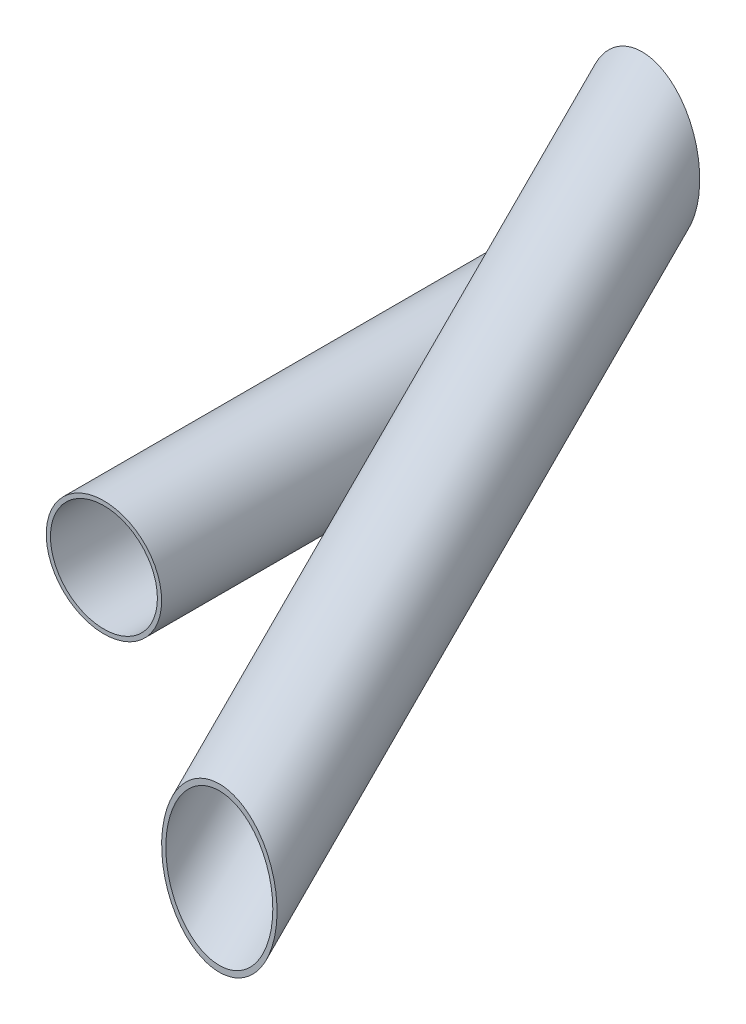
ISO-10303-21;
HEADER;
FILE_DESCRIPTION(('STEP AP214'),'2;1');
FILE_NAME('part.step','',(''),(''),'','','');
FILE_SCHEMA(('AUTOMOTIVE_DESIGN { 1 0 10303 214 1 1 1 1 }'));
ENDSEC;
DATA;
#1=APPLICATION_CONTEXT('core data for automotive mechanical design processes');
#2=APPLICATION_PROTOCOL_DEFINITION('international standard','automotive_design',2000,#1);
#3=PRODUCT_CONTEXT('',#1,'mechanical');
#4=PRODUCT('Part','Part','',(#3));
#5=PRODUCT_RELATED_PRODUCT_CATEGORY('part','',(#4));
#6=PRODUCT_DEFINITION_FORMATION('','',#4);
#7=PRODUCT_DEFINITION_CONTEXT('part definition',#1,'design');
#8=PRODUCT_DEFINITION('design','',#6,#7);
#9=PRODUCT_DEFINITION_SHAPE('','',#8);
#10=(LENGTH_UNIT() NAMED_UNIT(*) SI_UNIT(.MILLI.,.METRE.));
#11=(NAMED_UNIT(*) PLANE_ANGLE_UNIT() SI_UNIT($,.RADIAN.));
#12=(NAMED_UNIT(*) SI_UNIT($,.STERADIAN.) SOLID_ANGLE_UNIT());
#13=UNCERTAINTY_MEASURE_WITH_UNIT(LENGTH_MEASURE(1.E-05),#10,'distance_accuracy_value','');
#14=(GEOMETRIC_REPRESENTATION_CONTEXT(3) GLOBAL_UNCERTAINTY_ASSIGNED_CONTEXT((#13)) GLOBAL_UNIT_ASSIGNED_CONTEXT((#10,
#11,#12)) REPRESENTATION_CONTEXT('',''));
#15=CARTESIAN_POINT('',(0.,0.,0.));
#16=DIRECTION('',(0.,0.,1.));
#17=DIRECTION('',(1.,0.,0.));
#18=AXIS2_PLACEMENT_3D('',#15,#16,#17);
#19=CARTESIAN_POINT('',(27.3,-82.954015126393,82.9540151263927));
#20=DIRECTION('',(0.,0.707106781186549,-0.707106781186546));
#21=DIRECTION('',(0.,0.707106781186546,0.707106781186549));
#22=AXIS2_PLACEMENT_3D('',#19,#20,#21);
#23=CYLINDRICAL_SURFACE('',#22,13.65);
#24=CARTESIAN_POINT('',(27.3,-50.0000000000002,50.));
#25=DIRECTION('',(0.,0.,1.));
#26=DIRECTION('',(0.,1.,0.));
#27=AXIS2_PLACEMENT_3D('',#24,#25,#26);
#28=ELLIPSE('',#27,19.3040151263928,13.65);
#29=CARTESIAN_POINT('',(27.3,-30.6959848736074,50.));
#30=VERTEX_POINT('',#29);
#31=EDGE_CURVE('E11',#30,#30,#28,.T.);
#32=ORIENTED_EDGE('',*,*,#31,.F.);
#33=EDGE_LOOP('',(#32));
#34=FACE_BOUND('',#33,.T.);
#35=CARTESIAN_POINT('',(27.3,50.0000000000002,-50.));
#36=DIRECTION('',(0.,0.,1.));
#37=DIRECTION('',(0.,-1.,0.));
#38=AXIS2_PLACEMENT_3D('',#35,#36,#37);
#39=ELLIPSE('',#38,19.3040151263928,13.65);
#40=CARTESIAN_POINT('',(27.3,30.6959848736074,-50.));
#41=VERTEX_POINT('',#40);
#42=EDGE_CURVE('E49',#41,#41,#39,.F.);
#43=ORIENTED_EDGE('',*,*,#42,.F.);
#44=EDGE_LOOP('',(#43));
#45=FACE_BOUND('',#44,.T.);
#46=ADVANCED_FACE('F39',(#34,#45),#23,.T.);
#47=CARTESIAN_POINT('',(27.3,-82.954015126393,82.9540151263927));
#48=DIRECTION('',(0.,0.707106781186549,-0.707106781186546));
#49=DIRECTION('',(0.,0.707106781186546,0.707106781186549));
#50=AXIS2_PLACEMENT_3D('',#47,#48,#49);
#51=CYLINDRICAL_SURFACE('',#50,12.65);
#52=CARTESIAN_POINT('',(27.3,-50.0000000000002,50.));
#53=DIRECTION('',(0.,0.,1.));
#54=DIRECTION('',(0.,1.,0.));
#55=AXIS2_PLACEMENT_3D('',#52,#53,#54);
#56=ELLIPSE('',#55,17.8898015640197,12.65);
#57=CARTESIAN_POINT('',(27.3,-32.1101984359805,50.));
#58=VERTEX_POINT('',#57);
#59=EDGE_CURVE('E42',#58,#58,#56,.T.);
#60=ORIENTED_EDGE('',*,*,#59,.T.);
#61=EDGE_LOOP('',(#60));
#62=FACE_BOUND('',#61,.T.);
#63=CARTESIAN_POINT('',(27.3,50.0000000000002,-50.));
#64=DIRECTION('',(0.,0.,1.));
#65=DIRECTION('',(0.,-1.,0.));
#66=AXIS2_PLACEMENT_3D('',#63,#64,#65);
#67=ELLIPSE('',#66,17.8898015640197,12.65);
#68=CARTESIAN_POINT('',(27.3,32.1101984359805,-50.));
#69=VERTEX_POINT('',#68);
#70=EDGE_CURVE('E51',#69,#69,#67,.F.);
#71=ORIENTED_EDGE('',*,*,#70,.T.);
#72=EDGE_LOOP('',(#71));
#73=FACE_BOUND('',#72,.T.);
#74=ADVANCED_FACE('F61',(#62,#73),#51,.F.);
#75=CARTESIAN_POINT('',(0.,0.,50.));
#76=DIRECTION('',(0.,0.,1.));
#77=DIRECTION('',(1.,0.,0.));
#78=AXIS2_PLACEMENT_3D('',#75,#76,#77);
#79=PLANE('',#78);
#80=ORIENTED_EDGE('',*,*,#59,.F.);
#81=EDGE_LOOP('',(#80));
#82=FACE_BOUND('',#81,.T.);
#83=ORIENTED_EDGE('',*,*,#31,.T.);
#84=EDGE_LOOP('',(#83));
#85=FACE_BOUND('',#84,.T.);
#86=ADVANCED_FACE('F66',(#82,#85),#79,.T.);
#87=CARTESIAN_POINT('',(0.,0.,-50.));
#88=DIRECTION('',(0.,0.,1.));
#89=DIRECTION('',(1.,0.,0.));
#90=AXIS2_PLACEMENT_3D('',#87,#88,#89);
#91=PLANE('',#90);
#92=ORIENTED_EDGE('',*,*,#42,.T.);
#93=EDGE_LOOP('',(#92));
#94=FACE_BOUND('',#93,.T.);
#95=ORIENTED_EDGE('',*,*,#70,.F.);
#96=EDGE_LOOP('',(#95));
#97=FACE_BOUND('',#96,.T.);
#98=ADVANCED_FACE('F57',(#94,#97),#91,.F.);
#99=CLOSED_SHELL('',(#46,#74,#86,#98));
#100=MANIFOLD_SOLID_BREP('B2',#99);
#101=CARTESIAN_POINT('',(0.,0.,50.));
#102=DIRECTION('',(0.,0.,1.));
#103=DIRECTION('',(1.,0.,0.));
#104=AXIS2_PLACEMENT_3D('',#101,#102,#103);
#105=PLANE('',#104);
#106=CARTESIAN_POINT('',(0.,0.,50.));
#107=DIRECTION('',(0.,0.,1.));
#108=DIRECTION('',(1.,0.,0.));
#109=AXIS2_PLACEMENT_3D('',#106,#107,#108);
#110=CIRCLE('',#109,13.65);
#111=CARTESIAN_POINT('',(13.65,0.,50.));
#112=VERTEX_POINT('',#111);
#113=EDGE_CURVE('E38',#112,#112,#110,.T.);
#114=ORIENTED_EDGE('',*,*,#113,.T.);
#115=EDGE_LOOP('',(#114));
#116=FACE_BOUND('',#115,.T.);
#117=CARTESIAN_POINT('',(0.,0.,50.));
#118=DIRECTION('',(0.,0.,1.));
#119=DIRECTION('',(1.,0.,0.));
#120=AXIS2_PLACEMENT_3D('',#117,#118,#119);
#121=CIRCLE('',#120,12.65);
#122=CARTESIAN_POINT('',(12.65,0.,50.));
#123=VERTEX_POINT('',#122);
#124=EDGE_CURVE('E112',#123,#123,#121,.T.);
#125=ORIENTED_EDGE('',*,*,#124,.F.);
#126=EDGE_LOOP('',(#125));
#127=FACE_BOUND('',#126,.T.);
#128=ADVANCED_FACE('F101',(#116,#127),#105,.T.);
#129=CARTESIAN_POINT('',(0.,0.,-50.));
#130=DIRECTION('',(0.,0.,1.));
#131=DIRECTION('',(1.,0.,0.));
#132=AXIS2_PLACEMENT_3D('',#129,#130,#131);
#133=PLANE('',#132);
#134=CARTESIAN_POINT('',(0.,0.,-50.));
#135=DIRECTION('',(0.,0.,1.));
#136=DIRECTION('',(1.,0.,0.));
#137=AXIS2_PLACEMENT_3D('',#134,#135,#136);
#138=CIRCLE('',#137,13.65);
#139=CARTESIAN_POINT('',(13.65,0.,-50.));
#140=VERTEX_POINT('',#139);
#141=EDGE_CURVE('E105',#140,#140,#138,.T.);
#142=ORIENTED_EDGE('',*,*,#141,.F.);
#143=EDGE_LOOP('',(#142));
#144=FACE_BOUND('',#143,.T.);
#145=CARTESIAN_POINT('',(0.,0.,-50.));
#146=DIRECTION('',(0.,0.,1.));
#147=DIRECTION('',(1.,0.,0.));
#148=AXIS2_PLACEMENT_3D('',#145,#146,#147);
#149=CIRCLE('',#148,12.65);
#150=CARTESIAN_POINT('',(12.65,0.,-50.));
#151=VERTEX_POINT('',#150);
#152=EDGE_CURVE('E114',#151,#151,#149,.T.);
#153=ORIENTED_EDGE('',*,*,#152,.T.);
#154=EDGE_LOOP('',(#153));
#155=FACE_BOUND('',#154,.T.);
#156=ADVANCED_FACE('F124',(#144,#155),#133,.F.);
#157=CARTESIAN_POINT('',(0.,0.,50.));
#158=DIRECTION('',(0.,0.,-1.));
#159=DIRECTION('',(-1.,0.,0.));
#160=AXIS2_PLACEMENT_3D('',#157,#158,#159);
#161=CYLINDRICAL_SURFACE('',#160,13.65);
#162=ORIENTED_EDGE('',*,*,#113,.F.);
#163=EDGE_LOOP('',(#162));
#164=FACE_BOUND('',#163,.T.);
#165=ORIENTED_EDGE('',*,*,#141,.T.);
#166=EDGE_LOOP('',(#165));
#167=FACE_BOUND('',#166,.T.);
#168=ADVANCED_FACE('F103',(#164,#167),#161,.T.);
#169=CARTESIAN_POINT('',(0.,0.,50.));
#170=DIRECTION('',(0.,0.,-1.));
#171=DIRECTION('',(-1.,0.,0.));
#172=AXIS2_PLACEMENT_3D('',#169,#170,#171);
#173=CYLINDRICAL_SURFACE('',#172,12.65);
#174=ORIENTED_EDGE('',*,*,#124,.T.);
#175=EDGE_LOOP('',(#174));
#176=FACE_BOUND('',#175,.T.);
#177=ORIENTED_EDGE('',*,*,#152,.F.);
#178=EDGE_LOOP('',(#177));
#179=FACE_BOUND('',#178,.T.);
#180=ADVANCED_FACE('F120',(#176,#179),#173,.F.);
#181=CLOSED_SHELL('',(#128,#156,#168,#180));
#182=MANIFOLD_SOLID_BREP('B6',#181);
#183=ADVANCED_BREP_SHAPE_REPRESENTATION('',(#18,#100,#182),#14);
#184=SHAPE_DEFINITION_REPRESENTATION(#9,#183);
ENDSEC;
END-ISO-10303-21;
